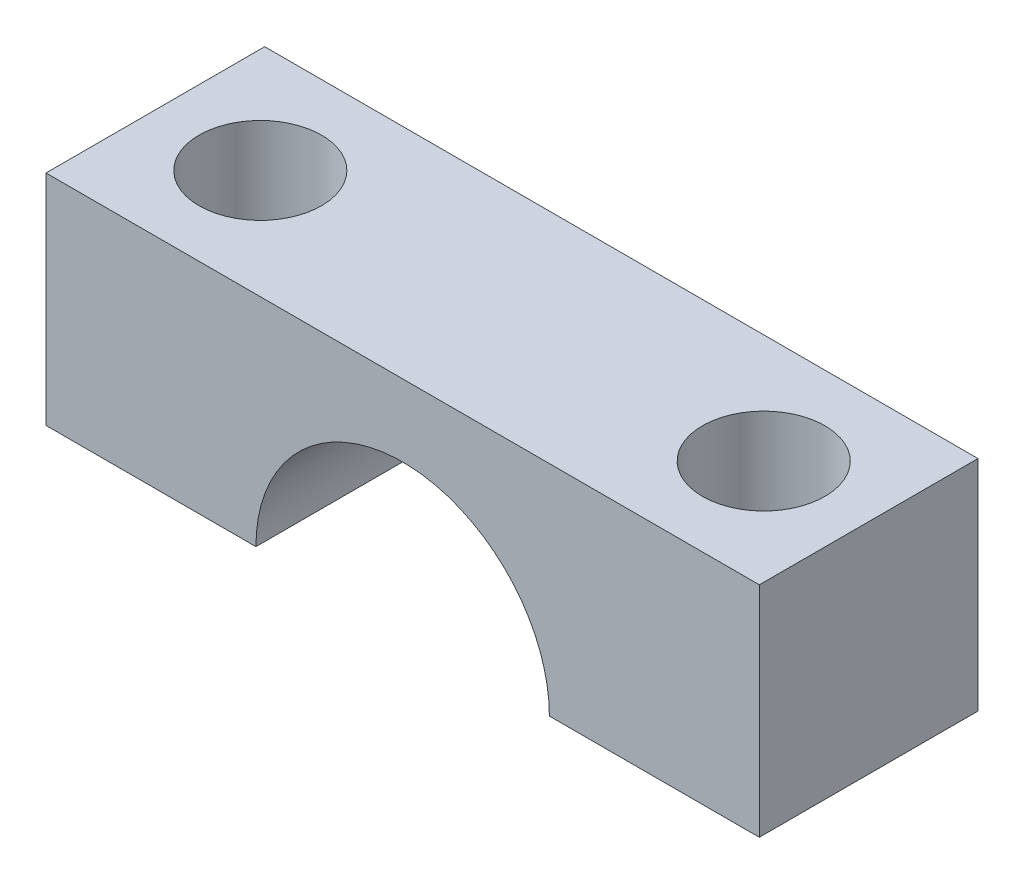
ISO-10303-21;
HEADER;
FILE_DESCRIPTION(('STEP AP214'),'2;1');
FILE_NAME('part.step','',(''),(''),'','','');
FILE_SCHEMA(('AUTOMOTIVE_DESIGN { 1 0 10303 214 1 1 1 1 }'));
ENDSEC;
DATA;
#1=APPLICATION_CONTEXT('core data for automotive mechanical design processes');
#2=APPLICATION_PROTOCOL_DEFINITION('international standard','automotive_design',2000,#1);
#3=PRODUCT_CONTEXT('',#1,'mechanical');
#4=PRODUCT('Part','Part','',(#3));
#5=PRODUCT_RELATED_PRODUCT_CATEGORY('part','',(#4));
#6=PRODUCT_DEFINITION_FORMATION('','',#4);
#7=PRODUCT_DEFINITION_CONTEXT('part definition',#1,'design');
#8=PRODUCT_DEFINITION('design','',#6,#7);
#9=PRODUCT_DEFINITION_SHAPE('','',#8);
#10=(LENGTH_UNIT() NAMED_UNIT(*) SI_UNIT(.MILLI.,.METRE.));
#11=(NAMED_UNIT(*) PLANE_ANGLE_UNIT() SI_UNIT($,.RADIAN.));
#12=(NAMED_UNIT(*) SI_UNIT($,.STERADIAN.) SOLID_ANGLE_UNIT());
#13=UNCERTAINTY_MEASURE_WITH_UNIT(LENGTH_MEASURE(1.E-05),#10,'distance_accuracy_value','');
#14=(GEOMETRIC_REPRESENTATION_CONTEXT(3) GLOBAL_UNCERTAINTY_ASSIGNED_CONTEXT((#13)) GLOBAL_UNIT_ASSIGNED_CONTEXT((#10,
#11,#12)) REPRESENTATION_CONTEXT('',''));
#15=CARTESIAN_POINT('',(0.,0.,0.));
#16=DIRECTION('',(0.,0.,1.));
#17=DIRECTION('',(1.,0.,0.));
#18=AXIS2_PLACEMENT_3D('',#15,#16,#17);
#19=CARTESIAN_POINT('',(-8.155,-2.5,-5.));
#20=DIRECTION('',(0.,-1.,0.));
#21=DIRECTION('',(0.,0.,-1.));
#22=AXIS2_PLACEMENT_3D('',#19,#20,#21);
#23=PLANE('',#22);
#24=CARTESIAN_POINT('',(5.755,-2.5,-2.5));
#25=DIRECTION('',(0.,1.,0.));
#26=DIRECTION('',(0.,0.,1.));
#27=AXIS2_PLACEMENT_3D('',#24,#25,#26);
#28=CIRCLE('',#27,1.4);
#29=CARTESIAN_POINT('',(5.755,-2.5,-1.1));
#30=VERTEX_POINT('',#29);
#31=EDGE_CURVE('E148',#30,#30,#28,.T.);
#32=ORIENTED_EDGE('',*,*,#31,.T.);
#33=EDGE_LOOP('',(#32));
#34=FACE_BOUND('',#33,.T.);
#35=DIRECTION('',(0.,0.,1.));
#36=VECTOR('',#35,1.);
#37=CARTESIAN_POINT('',(3.355,-2.5,-5.));
#38=LINE('',#37,#36);
#39=CARTESIAN_POINT('',(3.355,-2.5,-5.));
#40=VERTEX_POINT('',#39);
#41=CARTESIAN_POINT('',(3.355,-2.5,0.));
#42=VERTEX_POINT('',#41);
#43=EDGE_CURVE('E55',#40,#42,#38,.T.);
#44=ORIENTED_EDGE('',*,*,#43,.F.);
#45=DIRECTION('',(1.,0.,0.));
#46=VECTOR('',#45,1.);
#47=CARTESIAN_POINT('',(-8.155,-2.5,-5.));
#48=LINE('',#47,#46);
#49=CARTESIAN_POINT('',(8.155,-2.5,-5.));
#50=VERTEX_POINT('',#49);
#51=EDGE_CURVE('E87',#40,#50,#48,.T.);
#52=ORIENTED_EDGE('',*,*,#51,.T.);
#53=DIRECTION('',(0.,0.,1.));
#54=VECTOR('',#53,1.);
#55=CARTESIAN_POINT('',(8.155,-2.5,-5.));
#56=LINE('',#55,#54);
#57=CARTESIAN_POINT('',(8.155,-2.5,0.));
#58=VERTEX_POINT('',#57);
#59=EDGE_CURVE('E42',#50,#58,#56,.T.);
#60=ORIENTED_EDGE('',*,*,#59,.T.);
#61=DIRECTION('',(1.,0.,0.));
#62=VECTOR('',#61,1.);
#63=CARTESIAN_POINT('',(-8.155,-2.5,0.));
#64=LINE('',#63,#62);
#65=EDGE_CURVE('E124',#42,#58,#64,.T.);
#66=ORIENTED_EDGE('',*,*,#65,.F.);
#67=EDGE_LOOP('',(#44,#52,#60,#66));
#68=FACE_BOUND('',#67,.T.);
#69=ADVANCED_FACE('F38',(#34,#68),#23,.T.);
#70=CARTESIAN_POINT('',(-5.755,-2.5,-2.5));
#71=DIRECTION('',(0.,1.,0.));
#72=DIRECTION('',(0.,0.,1.));
#73=AXIS2_PLACEMENT_3D('',#70,#71,#72);
#74=CIRCLE('',#73,1.4);
#75=CARTESIAN_POINT('',(-5.755,-2.5,-1.1));
#76=VERTEX_POINT('',#75);
#77=EDGE_CURVE('E147',#76,#76,#74,.T.);
#78=ORIENTED_EDGE('',*,*,#77,.T.);
#79=EDGE_LOOP('',(#78));
#80=FACE_BOUND('',#79,.T.);
#81=DIRECTION('',(0.,0.,1.));
#82=VECTOR('',#81,1.);
#83=CARTESIAN_POINT('',(-3.355,-2.5,-5.));
#84=LINE('',#83,#82);
#85=CARTESIAN_POINT('',(-3.355,-2.5,-5.));
#86=VERTEX_POINT('',#85);
#87=CARTESIAN_POINT('',(-3.355,-2.5,0.));
#88=VERTEX_POINT('',#87);
#89=EDGE_CURVE('E97',#86,#88,#84,.T.);
#90=ORIENTED_EDGE('',*,*,#89,.T.);
#91=CARTESIAN_POINT('',(-8.155,-2.5,0.));
#92=VERTEX_POINT('',#91);
#93=EDGE_CURVE('E121',#92,#88,#64,.T.);
#94=ORIENTED_EDGE('',*,*,#93,.F.);
#95=DIRECTION('',(0.,0.,1.));
#96=VECTOR('',#95,1.);
#97=CARTESIAN_POINT('',(-8.155,-2.5,-5.));
#98=LINE('',#97,#96);
#99=CARTESIAN_POINT('',(-8.155,-2.5,-5.));
#100=VERTEX_POINT('',#99);
#101=EDGE_CURVE('E11',#100,#92,#98,.T.);
#102=ORIENTED_EDGE('',*,*,#101,.F.);
#103=EDGE_CURVE('E107',#100,#86,#48,.T.);
#104=ORIENTED_EDGE('',*,*,#103,.T.);
#105=EDGE_LOOP('',(#90,#94,#102,#104));
#106=FACE_BOUND('',#105,.T.);
#107=ADVANCED_FACE('F40',(#80,#106),#23,.T.);
#108=CARTESIAN_POINT('',(-8.155,-2.5,-5.));
#109=DIRECTION('',(1.,0.,0.));
#110=DIRECTION('',(0.,0.,-1.));
#111=AXIS2_PLACEMENT_3D('',#108,#109,#110);
#112=PLANE('',#111);
#113=DIRECTION('',(0.,1.,0.));
#114=VECTOR('',#113,1.);
#115=CARTESIAN_POINT('',(-8.155,-2.5,0.));
#116=LINE('',#115,#114);
#117=CARTESIAN_POINT('',(-8.155,2.5,0.));
#118=VERTEX_POINT('',#117);
#119=EDGE_CURVE('E115',#92,#118,#116,.T.);
#120=ORIENTED_EDGE('',*,*,#119,.T.);
#121=DIRECTION('',(0.,0.,1.));
#122=VECTOR('',#121,1.);
#123=CARTESIAN_POINT('',(-8.155,2.5,-5.));
#124=LINE('',#123,#122);
#125=CARTESIAN_POINT('',(-8.155,2.5,-5.));
#126=VERTEX_POINT('',#125);
#127=EDGE_CURVE('E47',#126,#118,#124,.T.);
#128=ORIENTED_EDGE('',*,*,#127,.F.);
#129=DIRECTION('',(0.,1.,0.));
#130=VECTOR('',#129,1.);
#131=CARTESIAN_POINT('',(-8.155,-2.5,-5.));
#132=LINE('',#131,#130);
#133=EDGE_CURVE('E119',#100,#126,#132,.T.);
#134=ORIENTED_EDGE('',*,*,#133,.F.);
#135=ORIENTED_EDGE('',*,*,#101,.T.);
#136=EDGE_LOOP('',(#120,#128,#134,#135));
#137=FACE_BOUND('',#136,.T.);
#138=ADVANCED_FACE('F172',(#137),#112,.F.);
#139=CARTESIAN_POINT('',(-8.155,2.5,-5.));
#140=DIRECTION('',(0.,-1.,0.));
#141=DIRECTION('',(0.,0.,-1.));
#142=AXIS2_PLACEMENT_3D('',#139,#140,#141);
#143=PLANE('',#142);
#144=CARTESIAN_POINT('',(-5.755,2.5,-2.5));
#145=DIRECTION('',(0.,1.,0.));
#146=DIRECTION('',(0.,0.,1.));
#147=AXIS2_PLACEMENT_3D('',#144,#145,#146);
#148=CIRCLE('',#147,1.4);
#149=CARTESIAN_POINT('',(-5.755,2.5,-1.1));
#150=VERTEX_POINT('',#149);
#151=EDGE_CURVE('E142',#150,#150,#148,.T.);
#152=ORIENTED_EDGE('',*,*,#151,.F.);
#153=EDGE_LOOP('',(#152));
#154=FACE_BOUND('',#153,.T.);
#155=CARTESIAN_POINT('',(5.755,2.5,-2.5));
#156=DIRECTION('',(0.,1.,0.));
#157=DIRECTION('',(0.,0.,1.));
#158=AXIS2_PLACEMENT_3D('',#155,#156,#157);
#159=CIRCLE('',#158,1.4);
#160=CARTESIAN_POINT('',(5.755,2.5,-1.1));
#161=VERTEX_POINT('',#160);
#162=EDGE_CURVE('E144',#161,#161,#159,.T.);
#163=ORIENTED_EDGE('',*,*,#162,.F.);
#164=EDGE_LOOP('',(#163));
#165=FACE_BOUND('',#164,.T.);
#166=DIRECTION('',(1.,0.,0.));
#167=VECTOR('',#166,1.);
#168=CARTESIAN_POINT('',(-8.155,2.5,0.));
#169=LINE('',#168,#167);
#170=CARTESIAN_POINT('',(8.155,2.5,0.));
#171=VERTEX_POINT('',#170);
#172=EDGE_CURVE('E127',#118,#171,#169,.T.);
#173=ORIENTED_EDGE('',*,*,#172,.T.);
#174=DIRECTION('',(0.,0.,1.));
#175=VECTOR('',#174,1.);
#176=CARTESIAN_POINT('',(8.155,2.5,-5.));
#177=LINE('',#176,#175);
#178=CARTESIAN_POINT('',(8.155,2.5,-5.));
#179=VERTEX_POINT('',#178);
#180=EDGE_CURVE('E132',#179,#171,#177,.T.);
#181=ORIENTED_EDGE('',*,*,#180,.F.);
#182=DIRECTION('',(1.,0.,0.));
#183=VECTOR('',#182,1.);
#184=CARTESIAN_POINT('',(-8.155,2.5,-5.));
#185=LINE('',#184,#183);
#186=EDGE_CURVE('E113',#126,#179,#185,.T.);
#187=ORIENTED_EDGE('',*,*,#186,.F.);
#188=ORIENTED_EDGE('',*,*,#127,.T.);
#189=EDGE_LOOP('',(#173,#181,#187,#188));
#190=FACE_BOUND('',#189,.T.);
#191=ADVANCED_FACE('F178',(#154,#165,#190),#143,.F.);
#192=CARTESIAN_POINT('',(8.155,-2.5,-5.));
#193=DIRECTION('',(1.,0.,0.));
#194=DIRECTION('',(0.,0.,-1.));
#195=AXIS2_PLACEMENT_3D('',#192,#193,#194);
#196=PLANE('',#195);
#197=DIRECTION('',(0.,1.,0.));
#198=VECTOR('',#197,1.);
#199=CARTESIAN_POINT('',(8.155,-2.5,0.));
#200=LINE('',#199,#198);
#201=EDGE_CURVE('E123',#58,#171,#200,.T.);
#202=ORIENTED_EDGE('',*,*,#201,.F.);
#203=ORIENTED_EDGE('',*,*,#59,.F.);
#204=DIRECTION('',(0.,1.,0.));
#205=VECTOR('',#204,1.);
#206=CARTESIAN_POINT('',(8.155,-2.5,-5.));
#207=LINE('',#206,#205);
#208=EDGE_CURVE('E110',#50,#179,#207,.T.);
#209=ORIENTED_EDGE('',*,*,#208,.T.);
#210=ORIENTED_EDGE('',*,*,#180,.T.);
#211=EDGE_LOOP('',(#202,#203,#209,#210));
#212=FACE_BOUND('',#211,.T.);
#213=ADVANCED_FACE('F137',(#212),#196,.T.);
#214=CARTESIAN_POINT('',(0.,0.,-5.));
#215=DIRECTION('',(0.,0.,1.));
#216=DIRECTION('',(1.,0.,0.));
#217=AXIS2_PLACEMENT_3D('',#214,#215,#216);
#218=PLANE('',#217);
#219=ORIENTED_EDGE('',*,*,#51,.F.);
#220=CARTESIAN_POINT('',(0.,-2.5,-5.));
#221=DIRECTION('',(0.,0.,1.));
#222=DIRECTION('',(1.,0.,0.));
#223=AXIS2_PLACEMENT_3D('',#220,#221,#222);
#224=CIRCLE('',#223,3.355);
#225=EDGE_CURVE('E100',#40,#86,#224,.T.);
#226=ORIENTED_EDGE('',*,*,#225,.T.);
#227=ORIENTED_EDGE('',*,*,#103,.F.);
#228=ORIENTED_EDGE('',*,*,#133,.T.);
#229=ORIENTED_EDGE('',*,*,#186,.T.);
#230=ORIENTED_EDGE('',*,*,#208,.F.);
#231=EDGE_LOOP('',(#219,#226,#227,#228,#229,#230));
#232=FACE_BOUND('',#231,.T.);
#233=ADVANCED_FACE('F106',(#232),#218,.F.);
#234=CARTESIAN_POINT('',(0.,0.,0.));
#235=DIRECTION('',(0.,0.,1.));
#236=DIRECTION('',(1.,0.,0.));
#237=AXIS2_PLACEMENT_3D('',#234,#235,#236);
#238=PLANE('',#237);
#239=CARTESIAN_POINT('',(0.,-2.5,0.));
#240=DIRECTION('',(0.,0.,1.));
#241=DIRECTION('',(1.,0.,0.));
#242=AXIS2_PLACEMENT_3D('',#239,#240,#241);
#243=CIRCLE('',#242,3.355);
#244=EDGE_CURVE('E101',#42,#88,#243,.T.);
#245=ORIENTED_EDGE('',*,*,#244,.F.);
#246=ORIENTED_EDGE('',*,*,#65,.T.);
#247=ORIENTED_EDGE('',*,*,#201,.T.);
#248=ORIENTED_EDGE('',*,*,#172,.F.);
#249=ORIENTED_EDGE('',*,*,#119,.F.);
#250=ORIENTED_EDGE('',*,*,#93,.T.);
#251=EDGE_LOOP('',(#245,#246,#247,#248,#249,#250));
#252=FACE_BOUND('',#251,.T.);
#253=ADVANCED_FACE('F140',(#252),#238,.T.);
#254=CARTESIAN_POINT('',(0.,-2.5,-5.));
#255=DIRECTION('',(0.,0.,1.));
#256=DIRECTION('',(1.,0.,0.));
#257=AXIS2_PLACEMENT_3D('',#254,#255,#256);
#258=CYLINDRICAL_SURFACE('',#257,3.355);
#259=ORIENTED_EDGE('',*,*,#244,.T.);
#260=ORIENTED_EDGE('',*,*,#89,.F.);
#261=ORIENTED_EDGE('',*,*,#225,.F.);
#262=ORIENTED_EDGE('',*,*,#43,.T.);
#263=EDGE_LOOP('',(#259,#260,#261,#262));
#264=FACE_BOUND('',#263,.T.);
#265=ADVANCED_FACE('F99',(#264),#258,.F.);
#266=CARTESIAN_POINT('',(5.755,2.5,-2.5));
#267=DIRECTION('',(0.,-1.,0.));
#268=DIRECTION('',(0.,0.,-1.));
#269=AXIS2_PLACEMENT_3D('',#266,#267,#268);
#270=CYLINDRICAL_SURFACE('',#269,1.4);
#271=ORIENTED_EDGE('',*,*,#162,.T.);
#272=EDGE_LOOP('',(#271));
#273=FACE_BOUND('',#272,.T.);
#274=ORIENTED_EDGE('',*,*,#31,.F.);
#275=EDGE_LOOP('',(#274));
#276=FACE_BOUND('',#275,.T.);
#277=ADVANCED_FACE('F159',(#273,#276),#270,.F.);
#278=CARTESIAN_POINT('',(-5.755,2.5,-2.5));
#279=DIRECTION('',(0.,-1.,0.));
#280=DIRECTION('',(0.,0.,-1.));
#281=AXIS2_PLACEMENT_3D('',#278,#279,#280);
#282=CYLINDRICAL_SURFACE('',#281,1.4);
#283=ORIENTED_EDGE('',*,*,#151,.T.);
#284=EDGE_LOOP('',(#283));
#285=FACE_BOUND('',#284,.T.);
#286=ORIENTED_EDGE('',*,*,#77,.F.);
#287=EDGE_LOOP('',(#286));
#288=FACE_BOUND('',#287,.T.);
#289=ADVANCED_FACE('F157',(#285,#288),#282,.F.);
#290=CLOSED_SHELL('',(#69,#107,#138,#191,#213,#233,#253,#265,#277,#289));
#291=MANIFOLD_SOLID_BREP('B2',#290);
#292=ADVANCED_BREP_SHAPE_REPRESENTATION('',(#18,#291),#14);
#293=SHAPE_DEFINITION_REPRESENTATION(#9,#292);
ENDSEC;
END-ISO-10303-21;
